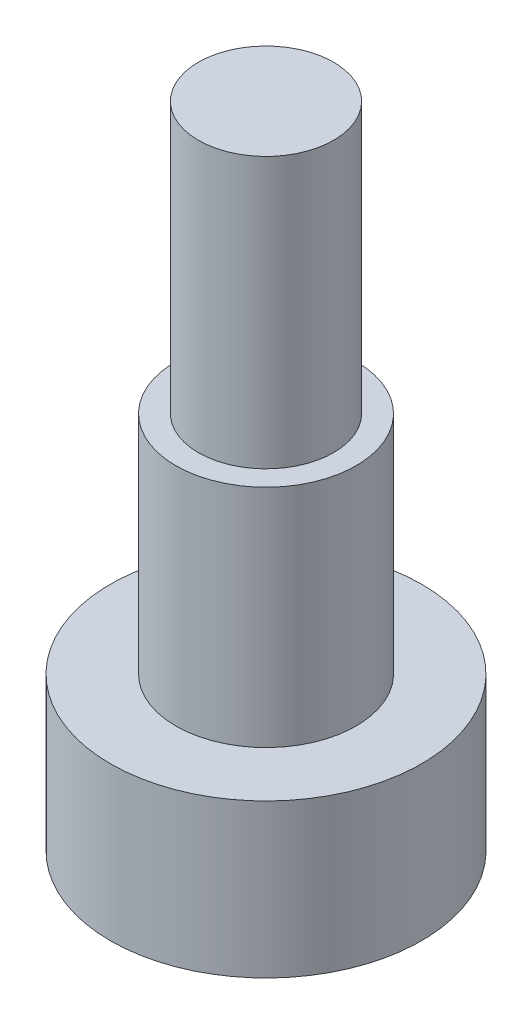
ISO-10303-21;
HEADER;
FILE_DESCRIPTION(('STEP AP214'),'2;1');
FILE_NAME('part.step','',(''),(''),'','','');
FILE_SCHEMA(('AUTOMOTIVE_DESIGN { 1 0 10303 214 1 1 1 1 }'));
ENDSEC;
DATA;
#1=APPLICATION_CONTEXT('core data for automotive mechanical design processes');
#2=APPLICATION_PROTOCOL_DEFINITION('international standard','automotive_design',2000,#1);
#3=PRODUCT_CONTEXT('',#1,'mechanical');
#4=PRODUCT('Part','Part','',(#3));
#5=PRODUCT_RELATED_PRODUCT_CATEGORY('part','',(#4));
#6=PRODUCT_DEFINITION_FORMATION('','',#4);
#7=PRODUCT_DEFINITION_CONTEXT('part definition',#1,'design');
#8=PRODUCT_DEFINITION('design','',#6,#7);
#9=PRODUCT_DEFINITION_SHAPE('','',#8);
#10=(LENGTH_UNIT() NAMED_UNIT(*) SI_UNIT(.MILLI.,.METRE.));
#11=(NAMED_UNIT(*) PLANE_ANGLE_UNIT() SI_UNIT($,.RADIAN.));
#12=(NAMED_UNIT(*) SI_UNIT($,.STERADIAN.) SOLID_ANGLE_UNIT());
#13=UNCERTAINTY_MEASURE_WITH_UNIT(LENGTH_MEASURE(1.E-05),#10,'distance_accuracy_value','');
#14=(GEOMETRIC_REPRESENTATION_CONTEXT(3) GLOBAL_UNCERTAINTY_ASSIGNED_CONTEXT((#13)) GLOBAL_UNIT_ASSIGNED_CONTEXT((#10,
#11,#12)) REPRESENTATION_CONTEXT('',''));
#15=CARTESIAN_POINT('',(0.,0.,0.));
#16=DIRECTION('',(0.,0.,1.));
#17=DIRECTION('',(1.,0.,0.));
#18=AXIS2_PLACEMENT_3D('',#15,#16,#17);
#19=CARTESIAN_POINT('',(0.,3.4,0.));
#20=DIRECTION('',(0.,-1.,0.));
#21=DIRECTION('',(0.,0.,-1.));
#22=AXIS2_PLACEMENT_3D('',#19,#20,#21);
#23=CYLINDRICAL_SURFACE('',#22,3.45);
#24=CARTESIAN_POINT('',(0.,3.4,0.));
#25=DIRECTION('',(0.,1.,0.));
#26=DIRECTION('',(0.,0.,1.));
#27=AXIS2_PLACEMENT_3D('',#24,#25,#26);
#28=CIRCLE('',#27,3.45);
#29=CARTESIAN_POINT('',(0.,3.4,3.45));
#30=VERTEX_POINT('',#29);
#31=EDGE_CURVE('E46',#30,#30,#28,.T.);
#32=ORIENTED_EDGE('',*,*,#31,.F.);
#33=EDGE_LOOP('',(#32));
#34=FACE_BOUND('',#33,.T.);
#35=CARTESIAN_POINT('',(0.,0.,0.));
#36=DIRECTION('',(0.,1.,0.));
#37=DIRECTION('',(0.,0.,1.));
#38=AXIS2_PLACEMENT_3D('',#35,#36,#37);
#39=CIRCLE('',#38,3.45);
#40=CARTESIAN_POINT('',(0.,0.,3.45));
#41=VERTEX_POINT('',#40);
#42=EDGE_CURVE('E37',#41,#41,#39,.T.);
#43=ORIENTED_EDGE('',*,*,#42,.T.);
#44=EDGE_LOOP('',(#43));
#45=FACE_BOUND('',#44,.T.);
#46=ADVANCED_FACE('F34',(#34,#45),#23,.T.);
#47=CARTESIAN_POINT('',(0.,3.4,0.));
#48=DIRECTION('',(0.,1.,0.));
#49=DIRECTION('',(0.,0.,1.));
#50=AXIS2_PLACEMENT_3D('',#47,#48,#49);
#51=PLANE('',#50);
#52=CARTESIAN_POINT('',(0.,3.4,0.));
#53=DIRECTION('',(0.,1.,0.));
#54=DIRECTION('',(0.,0.,1.));
#55=AXIS2_PLACEMENT_3D('',#52,#53,#54);
#56=CIRCLE('',#55,2.);
#57=CARTESIAN_POINT('',(0.,3.4,2.));
#58=VERTEX_POINT('',#57);
#59=EDGE_CURVE('E41',#58,#58,#56,.T.);
#60=ORIENTED_EDGE('',*,*,#59,.F.);
#61=EDGE_LOOP('',(#60));
#62=FACE_BOUND('',#61,.T.);
#63=ORIENTED_EDGE('',*,*,#31,.T.);
#64=EDGE_LOOP('',(#63));
#65=FACE_BOUND('',#64,.T.);
#66=ADVANCED_FACE('F63',(#62,#65),#51,.T.);
#67=CARTESIAN_POINT('',(0.,0.,0.));
#68=DIRECTION('',(0.,1.,0.));
#69=DIRECTION('',(0.,0.,1.));
#70=AXIS2_PLACEMENT_3D('',#67,#68,#69);
#71=PLANE('',#70);
#72=ORIENTED_EDGE('',*,*,#42,.F.);
#73=EDGE_LOOP('',(#72));
#74=FACE_BOUND('',#73,.T.);
#75=ADVANCED_FACE('F60',(#74),#71,.F.);
#76=CARTESIAN_POINT('',(0.,8.4,0.));
#77=DIRECTION('',(0.,-1.,0.));
#78=DIRECTION('',(0.,0.,-1.));
#79=AXIS2_PLACEMENT_3D('',#76,#77,#78);
#80=CYLINDRICAL_SURFACE('',#79,2.);
#81=CARTESIAN_POINT('',(0.,8.4,0.));
#82=DIRECTION('',(0.,1.,0.));
#83=DIRECTION('',(0.,0.,1.));
#84=AXIS2_PLACEMENT_3D('',#81,#82,#83);
#85=CIRCLE('',#84,2.);
#86=CARTESIAN_POINT('',(0.,8.4,2.));
#87=VERTEX_POINT('',#86);
#88=EDGE_CURVE('E51',#87,#87,#85,.T.);
#89=ORIENTED_EDGE('',*,*,#88,.F.);
#90=EDGE_LOOP('',(#89));
#91=FACE_BOUND('',#90,.T.);
#92=ORIENTED_EDGE('',*,*,#59,.T.);
#93=EDGE_LOOP('',(#92));
#94=FACE_BOUND('',#93,.T.);
#95=ADVANCED_FACE('F62',(#91,#94),#80,.T.);
#96=CARTESIAN_POINT('',(0.,8.4,0.));
#97=DIRECTION('',(0.,1.,0.));
#98=DIRECTION('',(0.,0.,1.));
#99=AXIS2_PLACEMENT_3D('',#96,#97,#98);
#100=PLANE('',#99);
#101=CARTESIAN_POINT('',(0.,8.4,0.));
#102=DIRECTION('',(0.,1.,0.));
#103=DIRECTION('',(0.,0.,1.));
#104=AXIS2_PLACEMENT_3D('',#101,#102,#103);
#105=CIRCLE('',#104,1.5);
#106=CARTESIAN_POINT('',(0.,8.4,1.5));
#107=VERTEX_POINT('',#106);
#108=EDGE_CURVE('E10',#107,#107,#105,.T.);
#109=ORIENTED_EDGE('',*,*,#108,.F.);
#110=EDGE_LOOP('',(#109));
#111=FACE_BOUND('',#110,.T.);
#112=ORIENTED_EDGE('',*,*,#88,.T.);
#113=EDGE_LOOP('',(#112));
#114=FACE_BOUND('',#113,.T.);
#115=ADVANCED_FACE('F68',(#111,#114),#100,.T.);
#116=CARTESIAN_POINT('',(0.,14.4,0.));
#117=DIRECTION('',(0.,-1.,0.));
#118=DIRECTION('',(0.,0.,-1.));
#119=AXIS2_PLACEMENT_3D('',#116,#117,#118);
#120=CYLINDRICAL_SURFACE('',#119,1.5);
#121=CARTESIAN_POINT('',(0.,14.4,0.));
#122=DIRECTION('',(0.,1.,0.));
#123=DIRECTION('',(0.,0.,1.));
#124=AXIS2_PLACEMENT_3D('',#121,#122,#123);
#125=CIRCLE('',#124,1.5);
#126=CARTESIAN_POINT('',(0.,14.4,1.5));
#127=VERTEX_POINT('',#126);
#128=EDGE_CURVE('E50',#127,#127,#125,.T.);
#129=ORIENTED_EDGE('',*,*,#128,.F.);
#130=EDGE_LOOP('',(#129));
#131=FACE_BOUND('',#130,.T.);
#132=ORIENTED_EDGE('',*,*,#108,.T.);
#133=EDGE_LOOP('',(#132));
#134=FACE_BOUND('',#133,.T.);
#135=ADVANCED_FACE('F98',(#131,#134),#120,.T.);
#136=CARTESIAN_POINT('',(0.,14.4,0.));
#137=DIRECTION('',(0.,1.,0.));
#138=DIRECTION('',(0.,0.,1.));
#139=AXIS2_PLACEMENT_3D('',#136,#137,#138);
#140=PLANE('',#139);
#141=ORIENTED_EDGE('',*,*,#128,.T.);
#142=EDGE_LOOP('',(#141));
#143=FACE_BOUND('',#142,.T.);
#144=ADVANCED_FACE('F109',(#143),#140,.T.);
#145=CLOSED_SHELL('',(#46,#66,#75,#95,#115,#135,#144));
#146=MANIFOLD_SOLID_BREP('B2',#145);
#147=ADVANCED_BREP_SHAPE_REPRESENTATION('',(#18,#146),#14);
#148=SHAPE_DEFINITION_REPRESENTATION(#9,#147);
ENDSEC;
END-ISO-10303-21;
